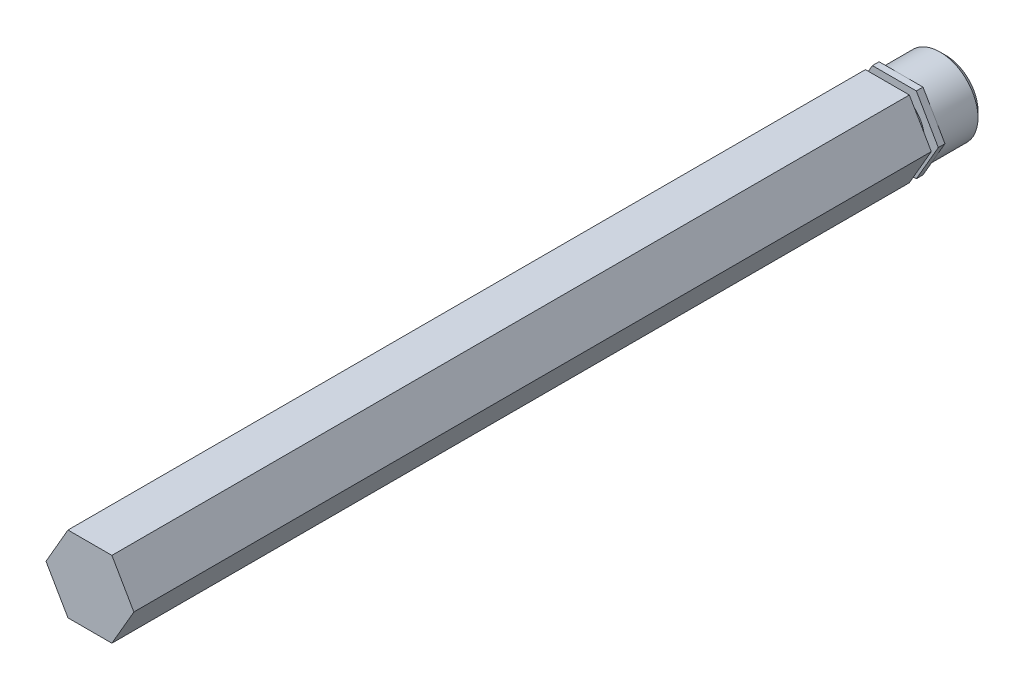
ISO-10303-21;
HEADER;
FILE_DESCRIPTION(('STEP AP214'),'2;1');
FILE_NAME('part.step','',(''),(''),'','','');
FILE_SCHEMA(('AUTOMOTIVE_DESIGN { 1 0 10303 214 1 1 1 1 }'));
ENDSEC;
DATA;
#1=APPLICATION_CONTEXT('core data for automotive mechanical design processes');
#2=APPLICATION_PROTOCOL_DEFINITION('international standard','automotive_design',2000,#1);
#3=PRODUCT_CONTEXT('',#1,'mechanical');
#4=PRODUCT('Part','Part','',(#3));
#5=PRODUCT_RELATED_PRODUCT_CATEGORY('part','',(#4));
#6=PRODUCT_DEFINITION_FORMATION('','',#4);
#7=PRODUCT_DEFINITION_CONTEXT('part definition',#1,'design');
#8=PRODUCT_DEFINITION('design','',#6,#7);
#9=PRODUCT_DEFINITION_SHAPE('','',#8);
#10=(LENGTH_UNIT() NAMED_UNIT(*) SI_UNIT(.MILLI.,.METRE.));
#11=(NAMED_UNIT(*) PLANE_ANGLE_UNIT() SI_UNIT($,.RADIAN.));
#12=(NAMED_UNIT(*) SI_UNIT($,.STERADIAN.) SOLID_ANGLE_UNIT());
#13=UNCERTAINTY_MEASURE_WITH_UNIT(LENGTH_MEASURE(1.E-05),#10,'distance_accuracy_value','');
#14=(GEOMETRIC_REPRESENTATION_CONTEXT(3) GLOBAL_UNCERTAINTY_ASSIGNED_CONTEXT((#13)) GLOBAL_UNIT_ASSIGNED_CONTEXT((#10,
#11,#12)) REPRESENTATION_CONTEXT('',''));
#15=CARTESIAN_POINT('',(0.,0.,0.));
#16=DIRECTION('',(0.,0.,1.));
#17=DIRECTION('',(1.,0.,0.));
#18=AXIS2_PLACEMENT_3D('',#15,#16,#17);
#19=CARTESIAN_POINT('',(7.33234841870822,0.,-76.1999999999995));
#20=DIRECTION('',(0.,0.,1.));
#21=DIRECTION('',(0.,-1.,0.));
#22=AXIS2_PLACEMENT_3D('',#19,#20,#21);
#23=PLANE('',#22);
#24=CARTESIAN_POINT('',(0.,0.,-76.1999999999148));
#25=DIRECTION('',(0.,0.,1.));
#26=DIRECTION('',(1.,0.,0.));
#27=AXIS2_PLACEMENT_3D('',#24,#25,#26);
#28=CIRCLE('',#27,5.34999999996444);
#29=CARTESIAN_POINT('',(5.34999999996444,0.,-76.1999999999148));
#30=VERTEX_POINT('',#29);
#31=EDGE_CURVE('E20',#30,#30,#28,.T.);
#32=ORIENTED_EDGE('',*,*,#31,.F.);
#33=EDGE_LOOP('',(#32));
#34=FACE_BOUND('',#33,.T.);
#35=ADVANCED_FACE('F17',(#34),#23,.F.);
#36=CARTESIAN_POINT('',(0.,0.,-75.2000000000521));
#37=DIRECTION('',(0.,0.,1.));
#38=DIRECTION('',(1.,0.,0.));
#39=AXIS2_PLACEMENT_3D('',#36,#37,#38);
#40=CONICAL_SURFACE('',#39,6.34999999982711,0.785398163397448);
#41=ORIENTED_EDGE('',*,*,#31,.T.);
#42=EDGE_LOOP('',(#41));
#43=FACE_BOUND('',#42,.T.);
#44=CARTESIAN_POINT('',(0.,0.,-75.1999999999995));
#45=DIRECTION('',(0.,0.,-1.));
#46=DIRECTION('',(0.,1.,0.));
#47=AXIS2_PLACEMENT_3D('',#44,#45,#46);
#48=CIRCLE('',#47,6.34999999999998);
#49=CARTESIAN_POINT('',(0.,6.34999999999997,-75.1999999999995));
#50=VERTEX_POINT('',#49);
#51=EDGE_CURVE('E134',#50,#50,#48,.F.);
#52=ORIENTED_EDGE('',*,*,#51,.F.);
#53=EDGE_LOOP('',(#52));
#54=FACE_BOUND('',#53,.T.);
#55=ADVANCED_FACE('F504',(#43,#54),#40,.T.);
#56=CARTESIAN_POINT('',(0.,0.,-68.7039999999995));
#57=DIRECTION('',(0.,0.,-1.));
#58=DIRECTION('',(0.,1.,0.));
#59=AXIS2_PLACEMENT_3D('',#56,#57,#58);
#60=CYLINDRICAL_SURFACE('',#59,6.34999999999998);
#61=CARTESIAN_POINT('',(0.,0.,-68.7039999999995));
#62=DIRECTION('',(0.,0.,-1.));
#63=DIRECTION('',(0.,1.,0.));
#64=AXIS2_PLACEMENT_3D('',#61,#62,#63);
#65=CIRCLE('',#64,6.34999999999998);
#66=CARTESIAN_POINT('',(5.49926131403117,-3.175,-68.7039999999995));
#67=VERTEX_POINT('',#66);
#68=CARTESIAN_POINT('',(5.49926131403118,3.17499999999998,-68.7039999999995));
#69=VERTEX_POINT('',#68);
#70=EDGE_CURVE('E121',#67,#69,#65,.F.);
#71=ORIENTED_EDGE('',*,*,#70,.F.);
#72=CARTESIAN_POINT('',(0.,0.,-68.7039999999995));
#73=DIRECTION('',(0.,0.,-1.));
#74=DIRECTION('',(0.,1.,0.));
#75=AXIS2_PLACEMENT_3D('',#72,#73,#74);
#76=CIRCLE('',#75,6.34999999999998);
#77=CARTESIAN_POINT('',(0.,-6.35000000000001,-68.7039999999995));
#78=VERTEX_POINT('',#77);
#79=EDGE_CURVE('E129',#78,#67,#76,.F.);
#80=ORIENTED_EDGE('',*,*,#79,.F.);
#81=CARTESIAN_POINT('',(0.,0.,-68.7039999999995));
#82=DIRECTION('',(0.,0.,-1.));
#83=DIRECTION('',(0.,1.,0.));
#84=AXIS2_PLACEMENT_3D('',#81,#82,#83);
#85=CIRCLE('',#84,6.34999999999998);
#86=CARTESIAN_POINT('',(-5.49926131403118,-3.17500000000001,-68.7039999999995));
#87=VERTEX_POINT('',#86);
#88=EDGE_CURVE('E142',#87,#78,#85,.F.);
#89=ORIENTED_EDGE('',*,*,#88,.F.);
#90=CARTESIAN_POINT('',(0.,0.,-68.7039999999995));
#91=DIRECTION('',(0.,0.,-1.));
#92=DIRECTION('',(0.,1.,0.));
#93=AXIS2_PLACEMENT_3D('',#90,#91,#92);
#94=CIRCLE('',#93,6.34999999999998);
#95=CARTESIAN_POINT('',(-5.49926131403118,3.17499999999998,-68.7039999999995));
#96=VERTEX_POINT('',#95);
#97=EDGE_CURVE('E143',#96,#87,#94,.F.);
#98=ORIENTED_EDGE('',*,*,#97,.F.);
#99=CARTESIAN_POINT('',(0.,0.,-68.7039999999995));
#100=DIRECTION('',(0.,0.,-1.));
#101=DIRECTION('',(0.,1.,0.));
#102=AXIS2_PLACEMENT_3D('',#99,#100,#101);
#103=CIRCLE('',#102,6.34999999999998);
#104=CARTESIAN_POINT('',(0.,6.34999999999999,-68.7039999999995));
#105=VERTEX_POINT('',#104);
#106=EDGE_CURVE('E178',#105,#96,#103,.F.);
#107=ORIENTED_EDGE('',*,*,#106,.F.);
#108=CARTESIAN_POINT('',(0.,0.,-68.7039999999995));
#109=DIRECTION('',(0.,0.,-1.));
#110=DIRECTION('',(0.,1.,0.));
#111=AXIS2_PLACEMENT_3D('',#108,#109,#110);
#112=CIRCLE('',#111,6.34999999999998);
#113=EDGE_CURVE('E132',#69,#105,#112,.F.);
#114=ORIENTED_EDGE('',*,*,#113,.F.);
#115=EDGE_LOOP('',(#71,#80,#89,#98,#107,#114));
#116=FACE_BOUND('',#115,.T.);
#117=ORIENTED_EDGE('',*,*,#51,.T.);
#118=EDGE_LOOP('',(#117));
#119=FACE_BOUND('',#118,.T.);
#120=ADVANCED_FACE('F126',(#116,#119),#60,.T.);
#121=CARTESIAN_POINT('',(0.,0.,-68.7039999999995));
#122=DIRECTION('',(0.,0.,-1.));
#123=DIRECTION('',(0.,1.,0.));
#124=AXIS2_PLACEMENT_3D('',#121,#122,#123);
#125=PLANE('',#124);
#126=DIRECTION('',(-0.499999999999999,-0.866025403784439,0.));
#127=VECTOR('',#126,1.);
#128=CARTESIAN_POINT('',(3.66617420935408,-6.35000000000003,-68.7039999999995));
#129=LINE('',#128,#127);
#130=CARTESIAN_POINT('',(7.33234841870823,0.,-68.7039999999995));
#131=VERTEX_POINT('',#130);
#132=EDGE_CURVE('E149',#131,#67,#129,.T.);
#133=ORIENTED_EDGE('',*,*,#132,.T.);
#134=ORIENTED_EDGE('',*,*,#70,.T.);
#135=DIRECTION('',(0.5,-0.866025403784439,0.));
#136=VECTOR('',#135,1.);
#137=CARTESIAN_POINT('',(7.33234841870824,0.,-68.7039999999995));
#138=LINE('',#137,#136);
#139=EDGE_CURVE('E156',#69,#131,#138,.T.);
#140=ORIENTED_EDGE('',*,*,#139,.T.);
#141=EDGE_LOOP('',(#133,#134,#140));
#142=FACE_BOUND('',#141,.T.);
#143=ADVANCED_FACE('F155',(#142),#125,.T.);
#144=CARTESIAN_POINT('',(0.,0.,-68.7039999999995));
#145=DIRECTION('',(0.,0.,-1.));
#146=DIRECTION('',(0.,1.,0.));
#147=AXIS2_PLACEMENT_3D('',#144,#145,#146);
#148=PLANE('',#147);
#149=DIRECTION('',(0.5,-0.866025403784439,0.));
#150=VECTOR('',#149,1.);
#151=CARTESIAN_POINT('',(7.33234841870824,0.,-68.7039999999995));
#152=LINE('',#151,#150);
#153=CARTESIAN_POINT('',(3.66617420935411,6.35000000000001,-68.7039999999995));
#154=VERTEX_POINT('',#153);
#155=EDGE_CURVE('E153',#154,#69,#152,.T.);
#156=ORIENTED_EDGE('',*,*,#155,.T.);
#157=ORIENTED_EDGE('',*,*,#113,.T.);
#158=DIRECTION('',(1.,0.,0.));
#159=VECTOR('',#158,1.);
#160=CARTESIAN_POINT('',(3.6661742093541,6.35000000000002,-68.7039999999995));
#161=LINE('',#160,#159);
#162=EDGE_CURVE('E186',#105,#154,#161,.T.);
#163=ORIENTED_EDGE('',*,*,#162,.T.);
#164=EDGE_LOOP('',(#156,#157,#163));
#165=FACE_BOUND('',#164,.T.);
#166=ADVANCED_FACE('F184',(#165),#148,.T.);
#167=CARTESIAN_POINT('',(0.,0.,-68.7039999999995));
#168=DIRECTION('',(0.,0.,-1.));
#169=DIRECTION('',(0.,1.,0.));
#170=AXIS2_PLACEMENT_3D('',#167,#168,#169);
#171=PLANE('',#170);
#172=ORIENTED_EDGE('',*,*,#106,.T.);
#173=DIRECTION('',(0.5,0.866025403784439,0.));
#174=VECTOR('',#173,1.);
#175=CARTESIAN_POINT('',(-3.66617420935412,6.35000000000001,-68.7039999999995));
#176=LINE('',#175,#174);
#177=CARTESIAN_POINT('',(-3.66617420935412,6.35000000000001,-68.7039999999995));
#178=VERTEX_POINT('',#177);
#179=EDGE_CURVE('E202',#96,#178,#176,.T.);
#180=ORIENTED_EDGE('',*,*,#179,.T.);
#181=DIRECTION('',(1.,0.,0.));
#182=VECTOR('',#181,1.);
#183=CARTESIAN_POINT('',(3.6661742093541,6.35000000000002,-68.7039999999995));
#184=LINE('',#183,#182);
#185=EDGE_CURVE('E195',#178,#105,#184,.T.);
#186=ORIENTED_EDGE('',*,*,#185,.T.);
#187=EDGE_LOOP('',(#172,#180,#186));
#188=FACE_BOUND('',#187,.T.);
#189=ADVANCED_FACE('F201',(#188),#171,.T.);
#190=CARTESIAN_POINT('',(0.,0.,-68.7039999999995));
#191=DIRECTION('',(0.,0.,-1.));
#192=DIRECTION('',(0.,1.,0.));
#193=AXIS2_PLACEMENT_3D('',#190,#191,#192);
#194=PLANE('',#193);
#195=ORIENTED_EDGE('',*,*,#97,.T.);
#196=DIRECTION('',(-0.500000000000001,0.866025403784438,0.));
#197=VECTOR('',#196,1.);
#198=CARTESIAN_POINT('',(-7.33234841870825,0.,-68.7039999999995));
#199=LINE('',#198,#197);
#200=CARTESIAN_POINT('',(-7.33234841870826,0.,-68.7039999999995));
#201=VERTEX_POINT('',#200);
#202=EDGE_CURVE('E240',#87,#201,#199,.T.);
#203=ORIENTED_EDGE('',*,*,#202,.T.);
#204=DIRECTION('',(0.5,0.866025403784439,0.));
#205=VECTOR('',#204,1.);
#206=CARTESIAN_POINT('',(-3.66617420935412,6.35000000000001,-68.7039999999995));
#207=LINE('',#206,#205);
#208=EDGE_CURVE('E214',#201,#96,#207,.T.);
#209=ORIENTED_EDGE('',*,*,#208,.T.);
#210=EDGE_LOOP('',(#195,#203,#209));
#211=FACE_BOUND('',#210,.T.);
#212=ADVANCED_FACE('F468',(#211),#194,.T.);
#213=CARTESIAN_POINT('',(0.,0.,-68.7039999999995));
#214=DIRECTION('',(0.,0.,-1.));
#215=DIRECTION('',(0.,1.,0.));
#216=AXIS2_PLACEMENT_3D('',#213,#214,#215);
#217=PLANE('',#216);
#218=DIRECTION('',(-1.,0.,0.));
#219=VECTOR('',#218,1.);
#220=CARTESIAN_POINT('',(-3.66617420935412,-6.35000000000002,-68.7039999999995));
#221=LINE('',#220,#219);
#222=CARTESIAN_POINT('',(3.66617420935408,-6.35000000000002,-68.7039999999995));
#223=VERTEX_POINT('',#222);
#224=EDGE_CURVE('E141',#223,#78,#221,.T.);
#225=ORIENTED_EDGE('',*,*,#224,.T.);
#226=ORIENTED_EDGE('',*,*,#79,.T.);
#227=DIRECTION('',(-0.499999999999999,-0.866025403784439,0.));
#228=VECTOR('',#227,1.);
#229=CARTESIAN_POINT('',(3.66617420935408,-6.35000000000003,-68.7039999999995));
#230=LINE('',#229,#228);
#231=EDGE_CURVE('E139',#67,#223,#230,.T.);
#232=ORIENTED_EDGE('',*,*,#231,.T.);
#233=EDGE_LOOP('',(#225,#226,#232));
#234=FACE_BOUND('',#233,.T.);
#235=ADVANCED_FACE('F138',(#234),#217,.T.);
#236=CARTESIAN_POINT('',(0.,0.,-68.7039999999995));
#237=DIRECTION('',(0.,0.,-1.));
#238=DIRECTION('',(0.,1.,0.));
#239=AXIS2_PLACEMENT_3D('',#236,#237,#238);
#240=PLANE('',#239);
#241=ORIENTED_EDGE('',*,*,#88,.T.);
#242=DIRECTION('',(-1.,0.,0.));
#243=VECTOR('',#242,1.);
#244=CARTESIAN_POINT('',(-3.66617420935412,-6.35000000000002,-68.7039999999995));
#245=LINE('',#244,#243);
#246=CARTESIAN_POINT('',(-3.66617420935413,-6.35000000000002,-68.7039999999995));
#247=VERTEX_POINT('',#246);
#248=EDGE_CURVE('E291',#78,#247,#245,.T.);
#249=ORIENTED_EDGE('',*,*,#248,.T.);
#250=DIRECTION('',(-0.500000000000001,0.866025403784438,0.));
#251=VECTOR('',#250,1.);
#252=CARTESIAN_POINT('',(-7.33234841870825,0.,-68.7039999999995));
#253=LINE('',#252,#251);
#254=EDGE_CURVE('E237',#247,#87,#253,.T.);
#255=ORIENTED_EDGE('',*,*,#254,.T.);
#256=EDGE_LOOP('',(#241,#249,#255));
#257=FACE_BOUND('',#256,.T.);
#258=ADVANCED_FACE('F296',(#257),#240,.T.);
#259=CARTESIAN_POINT('',(3.66617420935408,-6.35000000000003,76.1999999999996));
#260=DIRECTION('',(-0.866025403784439,0.499999999999999,0.));
#261=DIRECTION('',(-0.499999999999999,-0.866025403784439,0.));
#262=AXIS2_PLACEMENT_3D('',#259,#260,#261);
#263=PLANE('',#262);
#264=DIRECTION('',(0.,0.,1.));
#265=VECTOR('',#264,1.);
#266=CARTESIAN_POINT('',(3.66617420935408,-6.35000000000002,76.1999999999996));
#267=LINE('',#266,#265);
#268=CARTESIAN_POINT('',(3.66617420935408,-6.35000000000002,-67.5923999999995));
#269=VERTEX_POINT('',#268);
#270=EDGE_CURVE('E152',#269,#223,#267,.F.);
#271=ORIENTED_EDGE('',*,*,#270,.T.);
#272=ORIENTED_EDGE('',*,*,#231,.F.);
#273=ORIENTED_EDGE('',*,*,#132,.F.);
#274=DIRECTION('',(0.,0.,1.));
#275=VECTOR('',#274,1.);
#276=CARTESIAN_POINT('',(7.33234841870823,0.,76.1999999999996));
#277=LINE('',#276,#275);
#278=CARTESIAN_POINT('',(7.33234841870822,0.,-67.5923999999995));
#279=VERTEX_POINT('',#278);
#280=EDGE_CURVE('E203',#131,#279,#277,.T.);
#281=ORIENTED_EDGE('',*,*,#280,.T.);
#282=DIRECTION('',(0.500000000000002,0.866025403784438,0.));
#283=VECTOR('',#282,1.);
#284=CARTESIAN_POINT('',(3.66617420935408,-6.35000000000001,-67.5923999999996));
#285=LINE('',#284,#283);
#286=EDGE_CURVE('E262',#269,#279,#285,.T.);
#287=ORIENTED_EDGE('',*,*,#286,.F.);
#288=EDGE_LOOP('',(#271,#272,#273,#281,#287));
#289=FACE_BOUND('',#288,.T.);
#290=ADVANCED_FACE('F147',(#289),#263,.F.);
#291=CARTESIAN_POINT('',(7.33234841870824,0.,76.1999999999996));
#292=DIRECTION('',(-0.866025403784439,-0.5,0.));
#293=DIRECTION('',(0.5,-0.866025403784439,0.));
#294=AXIS2_PLACEMENT_3D('',#291,#292,#293);
#295=PLANE('',#294);
#296=ORIENTED_EDGE('',*,*,#280,.F.);
#297=ORIENTED_EDGE('',*,*,#139,.F.);
#298=ORIENTED_EDGE('',*,*,#155,.F.);
#299=DIRECTION('',(0.,0.,-1.));
#300=VECTOR('',#299,1.);
#301=CARTESIAN_POINT('',(3.6661742093541,6.35000000000002,76.1999999999996));
#302=LINE('',#301,#300);
#303=CARTESIAN_POINT('',(3.6661742093541,6.35000000000001,-67.5923999999995));
#304=VERTEX_POINT('',#303);
#305=EDGE_CURVE('E199',#154,#304,#302,.F.);
#306=ORIENTED_EDGE('',*,*,#305,.T.);
#307=DIRECTION('',(-0.499999999999999,0.866025403784439,0.));
#308=VECTOR('',#307,1.);
#309=CARTESIAN_POINT('',(7.33234841870822,0.,-67.5923999999996));
#310=LINE('',#309,#308);
#311=EDGE_CURVE('E264',#279,#304,#310,.T.);
#312=ORIENTED_EDGE('',*,*,#311,.F.);
#313=EDGE_LOOP('',(#296,#297,#298,#306,#312));
#314=FACE_BOUND('',#313,.T.);
#315=ADVANCED_FACE('F301',(#314),#295,.F.);
#316=CARTESIAN_POINT('',(3.6661742093541,6.35000000000002,76.1999999999996));
#317=DIRECTION('',(0.,-1.,0.));
#318=DIRECTION('',(0.,0.,-1.));
#319=AXIS2_PLACEMENT_3D('',#316,#317,#318);
#320=PLANE('',#319);
#321=ORIENTED_EDGE('',*,*,#305,.F.);
#322=ORIENTED_EDGE('',*,*,#162,.F.);
#323=ORIENTED_EDGE('',*,*,#185,.F.);
#324=DIRECTION('',(0.,0.,1.));
#325=VECTOR('',#324,1.);
#326=CARTESIAN_POINT('',(-3.66617420935412,6.35,76.1999999999996));
#327=LINE('',#326,#325);
#328=CARTESIAN_POINT('',(-3.66617420935412,6.35000000000001,-67.5923999999995));
#329=VERTEX_POINT('',#328);
#330=EDGE_CURVE('E228',#178,#329,#327,.T.);
#331=ORIENTED_EDGE('',*,*,#330,.T.);
#332=DIRECTION('',(1.,0.,0.));
#333=VECTOR('',#332,1.);
#334=CARTESIAN_POINT('',(0.,6.35000000000001,-67.5923999999996));
#335=LINE('',#334,#333);
#336=EDGE_CURVE('E283',#304,#329,#335,.F.);
#337=ORIENTED_EDGE('',*,*,#336,.F.);
#338=EDGE_LOOP('',(#321,#322,#323,#331,#337));
#339=FACE_BOUND('',#338,.T.);
#340=ADVANCED_FACE('F193',(#339),#320,.F.);
#341=CARTESIAN_POINT('',(-3.66617420935412,6.35000000000001,76.1999999999996));
#342=DIRECTION('',(0.866025403784439,-0.5,0.));
#343=DIRECTION('',(0.5,0.866025403784439,0.));
#344=AXIS2_PLACEMENT_3D('',#341,#342,#343);
#345=PLANE('',#344);
#346=ORIENTED_EDGE('',*,*,#330,.F.);
#347=ORIENTED_EDGE('',*,*,#179,.F.);
#348=ORIENTED_EDGE('',*,*,#208,.F.);
#349=DIRECTION('',(0.,0.,1.));
#350=VECTOR('',#349,1.);
#351=CARTESIAN_POINT('',(-7.33234841870826,0.,76.1999999999996));
#352=LINE('',#351,#350);
#353=CARTESIAN_POINT('',(-7.33234841870826,0.,-67.5923999999995));
#354=VERTEX_POINT('',#353);
#355=EDGE_CURVE('E244',#201,#354,#352,.T.);
#356=ORIENTED_EDGE('',*,*,#355,.T.);
#357=DIRECTION('',(-0.5,-0.866025403784438,0.));
#358=VECTOR('',#357,1.);
#359=CARTESIAN_POINT('',(-3.66617420935412,6.35,-67.5923999999996));
#360=LINE('',#359,#358);
#361=EDGE_CURVE('E274',#329,#354,#360,.T.);
#362=ORIENTED_EDGE('',*,*,#361,.F.);
#363=EDGE_LOOP('',(#346,#347,#348,#356,#362));
#364=FACE_BOUND('',#363,.T.);
#365=ADVANCED_FACE('F273',(#364),#345,.F.);
#366=CARTESIAN_POINT('',(-7.33234841870825,0.,76.1999999999996));
#367=DIRECTION('',(0.866025403784438,0.500000000000001,0.));
#368=DIRECTION('',(-0.500000000000001,0.866025403784438,0.));
#369=AXIS2_PLACEMENT_3D('',#366,#367,#368);
#370=PLANE('',#369);
#371=ORIENTED_EDGE('',*,*,#355,.F.);
#372=ORIENTED_EDGE('',*,*,#202,.F.);
#373=ORIENTED_EDGE('',*,*,#254,.F.);
#374=DIRECTION('',(0.,0.,1.));
#375=VECTOR('',#374,1.);
#376=CARTESIAN_POINT('',(-3.66617420935413,-6.35000000000002,76.1999999999996));
#377=LINE('',#376,#375);
#378=CARTESIAN_POINT('',(-3.66617420935413,-6.35000000000002,-67.5923999999995));
#379=VERTEX_POINT('',#378);
#380=EDGE_CURVE('E265',#247,#379,#377,.T.);
#381=ORIENTED_EDGE('',*,*,#380,.T.);
#382=DIRECTION('',(0.500000000000001,-0.866025403784438,0.));
#383=VECTOR('',#382,1.);
#384=CARTESIAN_POINT('',(-7.33234841870825,0.,-67.5923999999996));
#385=LINE('',#384,#383);
#386=EDGE_CURVE('E259',#354,#379,#385,.T.);
#387=ORIENTED_EDGE('',*,*,#386,.F.);
#388=EDGE_LOOP('',(#371,#372,#373,#381,#387));
#389=FACE_BOUND('',#388,.T.);
#390=ADVANCED_FACE('F278',(#389),#370,.F.);
#391=CARTESIAN_POINT('',(-3.66617420935412,-6.35000000000002,76.1999999999996));
#392=DIRECTION('',(0.,1.,0.));
#393=DIRECTION('',(-1.,0.,0.));
#394=AXIS2_PLACEMENT_3D('',#391,#392,#393);
#395=PLANE('',#394);
#396=ORIENTED_EDGE('',*,*,#380,.F.);
#397=ORIENTED_EDGE('',*,*,#248,.F.);
#398=ORIENTED_EDGE('',*,*,#224,.F.);
#399=ORIENTED_EDGE('',*,*,#270,.F.);
#400=DIRECTION('',(1.,0.,0.));
#401=VECTOR('',#400,1.);
#402=CARTESIAN_POINT('',(0.,-6.35000000000001,-67.5923999999996));
#403=LINE('',#402,#401);
#404=EDGE_CURVE('E175',#379,#269,#403,.T.);
#405=ORIENTED_EDGE('',*,*,#404,.F.);
#406=EDGE_LOOP('',(#396,#397,#398,#399,#405));
#407=FACE_BOUND('',#406,.T.);
#408=ADVANCED_FACE('F298',(#407),#395,.F.);
#409=CARTESIAN_POINT('',(0.,9.67349289505183,-67.5923999999996));
#410=DIRECTION('',(0.,0.,1.));
#411=DIRECTION('',(0.,-1.,0.));
#412=AXIS2_PLACEMENT_3D('',#409,#410,#411);
#413=PLANE('',#412);
#414=ORIENTED_EDGE('',*,*,#386,.T.);
#415=ORIENTED_EDGE('',*,*,#404,.T.);
#416=ORIENTED_EDGE('',*,*,#286,.T.);
#417=ORIENTED_EDGE('',*,*,#311,.T.);
#418=ORIENTED_EDGE('',*,*,#336,.T.);
#419=ORIENTED_EDGE('',*,*,#361,.T.);
#420=EDGE_LOOP('',(#414,#415,#416,#417,#418,#419));
#421=FACE_BOUND('',#420,.T.);
#422=CARTESIAN_POINT('',(0.,0.,-67.5923999999996));
#423=DIRECTION('',(0.,0.,1.));
#424=DIRECTION('',(0.,-1.,0.));
#425=AXIS2_PLACEMENT_3D('',#422,#423,#424);
#426=CIRCLE('',#425,5.02919999999999);
#427=CARTESIAN_POINT('',(0.,-5.02919999999999,-67.5923999999996));
#428=VERTEX_POINT('',#427);
#429=EDGE_CURVE('E172',#428,#428,#426,.T.);
#430=ORIENTED_EDGE('',*,*,#429,.F.);
#431=EDGE_LOOP('',(#430));
#432=FACE_BOUND('',#431,.T.);
#433=ADVANCED_FACE('F299',(#421,#432),#413,.T.);
#434=CARTESIAN_POINT('',(0.,0.,-56.8163271417916));
#435=DIRECTION('',(0.,0.,1.));
#436=DIRECTION('',(0.,-1.,0.));
#437=AXIS2_PLACEMENT_3D('',#434,#435,#436);
#438=CYLINDRICAL_SURFACE('',#437,5.02919999999999);
#439=ORIENTED_EDGE('',*,*,#429,.T.);
#440=EDGE_LOOP('',(#439));
#441=FACE_BOUND('',#440,.T.);
#442=CARTESIAN_POINT('',(0.,0.,-66.4239999999996));
#443=DIRECTION('',(0.,0.,1.));
#444=DIRECTION('',(0.,-1.,0.));
#445=AXIS2_PLACEMENT_3D('',#442,#443,#444);
#446=CIRCLE('',#445,5.02919999999999);
#447=CARTESIAN_POINT('',(0.,-5.02919999999999,-66.4239999999996));
#448=VERTEX_POINT('',#447);
#449=EDGE_CURVE('E167',#448,#448,#446,.T.);
#450=ORIENTED_EDGE('',*,*,#449,.F.);
#451=EDGE_LOOP('',(#450));
#452=FACE_BOUND('',#451,.T.);
#453=ADVANCED_FACE('F345',(#441,#452),#438,.T.);
#454=CARTESIAN_POINT('',(-3.66617420935412,-6.35000000000002,76.1999999999996));
#455=DIRECTION('',(0.,1.,0.));
#456=DIRECTION('',(-1.,0.,0.));
#457=AXIS2_PLACEMENT_3D('',#454,#455,#456);
#458=PLANE('',#457);
#459=DIRECTION('',(0.,0.,1.));
#460=VECTOR('',#459,1.);
#461=CARTESIAN_POINT('',(-3.66617420935412,-6.35000000000003,76.1999999999996));
#462=LINE('',#461,#460);
#463=CARTESIAN_POINT('',(-3.66617420935412,-6.35000000000003,66.6749999999996));
#464=VERTEX_POINT('',#463);
#465=CARTESIAN_POINT('',(-3.66617420935412,-6.35000000000002,-66.4239999999995));
#466=VERTEX_POINT('',#465);
#467=EDGE_CURVE('E171',#464,#466,#462,.F.);
#468=ORIENTED_EDGE('',*,*,#467,.T.);
#469=DIRECTION('',(1.,0.,0.));
#470=VECTOR('',#469,1.);
#471=CARTESIAN_POINT('',(0.,-6.35000000000001,-66.4239999999996));
#472=LINE('',#471,#470);
#473=CARTESIAN_POINT('',(3.66617420935409,-6.35000000000002,-66.4239999999996));
#474=VERTEX_POINT('',#473);
#475=EDGE_CURVE('E548',#474,#466,#472,.F.);
#476=ORIENTED_EDGE('',*,*,#475,.F.);
#477=DIRECTION('',(0.,0.,1.));
#478=VECTOR('',#477,1.);
#479=CARTESIAN_POINT('',(3.66617420935409,-6.35000000000002,76.1999999999996));
#480=LINE('',#479,#478);
#481=CARTESIAN_POINT('',(3.6661742093541,-6.35000000000002,66.6749999999996));
#482=VERTEX_POINT('',#481);
#483=EDGE_CURVE('E174',#474,#482,#480,.T.);
#484=ORIENTED_EDGE('',*,*,#483,.T.);
#485=DIRECTION('',(1.,0.,0.));
#486=VECTOR('',#485,1.);
#487=CARTESIAN_POINT('',(0.,-6.35000000000003,66.6749999999996));
#488=LINE('',#487,#486);
#489=EDGE_CURVE('E549',#464,#482,#488,.T.);
#490=ORIENTED_EDGE('',*,*,#489,.F.);
#491=EDGE_LOOP('',(#468,#476,#484,#490));
#492=FACE_BOUND('',#491,.T.);
#493=ADVANCED_FACE('F341',(#492),#458,.F.);
#494=CARTESIAN_POINT('',(3.66617420935408,-6.35000000000003,76.1999999999996));
#495=DIRECTION('',(-0.866025403784439,0.499999999999999,0.));
#496=DIRECTION('',(-0.499999999999999,-0.866025403784439,0.));
#497=AXIS2_PLACEMENT_3D('',#494,#495,#496);
#498=PLANE('',#497);
#499=ORIENTED_EDGE('',*,*,#483,.F.);
#500=DIRECTION('',(-0.500000000000002,-0.866025403784438,0.));
#501=VECTOR('',#500,1.);
#502=CARTESIAN_POINT('',(7.33234841870822,0.,-66.4239999999996));
#503=LINE('',#502,#501);
#504=CARTESIAN_POINT('',(7.33234841870822,0.,-66.4239999999996));
#505=VERTEX_POINT('',#504);
#506=EDGE_CURVE('E170',#505,#474,#503,.T.);
#507=ORIENTED_EDGE('',*,*,#506,.F.);
#508=DIRECTION('',(0.,0.,1.));
#509=VECTOR('',#508,1.);
#510=CARTESIAN_POINT('',(7.33234841870823,0.,76.1999999999996));
#511=LINE('',#510,#509);
#512=CARTESIAN_POINT('',(7.33234841870821,0.,66.6749999999996));
#513=VERTEX_POINT('',#512);
#514=EDGE_CURVE('E552',#505,#513,#511,.T.);
#515=ORIENTED_EDGE('',*,*,#514,.T.);
#516=DIRECTION('',(0.499999999999997,0.86602540378444,0.));
#517=VECTOR('',#516,1.);
#518=CARTESIAN_POINT('',(3.6661742093541,-6.35000000000005,66.6749999999996));
#519=LINE('',#518,#517);
#520=EDGE_CURVE('E572',#482,#513,#519,.T.);
#521=ORIENTED_EDGE('',*,*,#520,.F.);
#522=EDGE_LOOP('',(#499,#507,#515,#521));
#523=FACE_BOUND('',#522,.T.);
#524=ADVANCED_FACE('F337',(#523),#498,.F.);
#525=CARTESIAN_POINT('',(7.33234841870824,0.,76.1999999999996));
#526=DIRECTION('',(-0.866025403784439,-0.5,0.));
#527=DIRECTION('',(0.5,-0.866025403784439,0.));
#528=AXIS2_PLACEMENT_3D('',#525,#526,#527);
#529=PLANE('',#528);
#530=ORIENTED_EDGE('',*,*,#514,.F.);
#531=DIRECTION('',(0.499999999999999,-0.866025403784439,0.));
#532=VECTOR('',#531,1.);
#533=CARTESIAN_POINT('',(3.6661742093541,6.35000000000001,-66.4239999999996));
#534=LINE('',#533,#532);
#535=CARTESIAN_POINT('',(3.66617420935411,6.35,-66.4239999999996));
#536=VERTEX_POINT('',#535);
#537=EDGE_CURVE('E559',#536,#505,#534,.T.);
#538=ORIENTED_EDGE('',*,*,#537,.F.);
#539=DIRECTION('',(0.,0.,-1.));
#540=VECTOR('',#539,1.);
#541=CARTESIAN_POINT('',(3.6661742093541,6.35000000000002,76.1999999999996));
#542=LINE('',#541,#540);
#543=CARTESIAN_POINT('',(3.66617420935411,6.35,66.6749999999996));
#544=VERTEX_POINT('',#543);
#545=EDGE_CURVE('E576',#536,#544,#542,.F.);
#546=ORIENTED_EDGE('',*,*,#545,.T.);
#547=DIRECTION('',(-0.499999999999998,0.866025403784439,0.));
#548=VECTOR('',#547,1.);
#549=CARTESIAN_POINT('',(7.33234841870821,0.,66.6749999999996));
#550=LINE('',#549,#548);
#551=EDGE_CURVE('E573',#513,#544,#550,.T.);
#552=ORIENTED_EDGE('',*,*,#551,.F.);
#553=EDGE_LOOP('',(#530,#538,#546,#552));
#554=FACE_BOUND('',#553,.T.);
#555=ADVANCED_FACE('F333',(#554),#529,.F.);
#556=CARTESIAN_POINT('',(-7.33234841870825,0.,76.1999999999996));
#557=DIRECTION('',(0.866025403784438,0.500000000000001,0.));
#558=DIRECTION('',(-0.500000000000001,0.866025403784438,0.));
#559=AXIS2_PLACEMENT_3D('',#556,#557,#558);
#560=PLANE('',#559);
#561=DIRECTION('',(0.,0.,1.));
#562=VECTOR('',#561,1.);
#563=CARTESIAN_POINT('',(-7.33234841870826,0.,76.1999999999996));
#564=LINE('',#563,#562);
#565=CARTESIAN_POINT('',(-7.33234841870826,0.,66.6749999999996));
#566=VERTEX_POINT('',#565);
#567=CARTESIAN_POINT('',(-7.33234841870826,0.,-66.4239999999996));
#568=VERTEX_POINT('',#567);
#569=EDGE_CURVE('E556',#566,#568,#564,.F.);
#570=ORIENTED_EDGE('',*,*,#569,.T.);
#571=DIRECTION('',(-0.500000000000001,0.866025403784438,0.));
#572=VECTOR('',#571,1.);
#573=CARTESIAN_POINT('',(-3.66617420935413,-6.35000000000001,-66.4239999999996));
#574=LINE('',#573,#572);
#575=EDGE_CURVE('E555',#466,#568,#574,.T.);
#576=ORIENTED_EDGE('',*,*,#575,.F.);
#577=ORIENTED_EDGE('',*,*,#467,.F.);
#578=DIRECTION('',(0.500000000000001,-0.866025403784438,0.));
#579=VECTOR('',#578,1.);
#580=CARTESIAN_POINT('',(-7.33234841870826,0.,66.6749999999996));
#581=LINE('',#580,#579);
#582=EDGE_CURVE('E589',#566,#464,#581,.T.);
#583=ORIENTED_EDGE('',*,*,#582,.F.);
#584=EDGE_LOOP('',(#570,#576,#577,#583));
#585=FACE_BOUND('',#584,.T.);
#586=ADVANCED_FACE('F329',(#585),#560,.F.);
#587=CARTESIAN_POINT('',(0.,9.67349289505183,-66.4239999999996));
#588=DIRECTION('',(0.,0.,-1.));
#589=DIRECTION('',(0.,1.,0.));
#590=AXIS2_PLACEMENT_3D('',#587,#588,#589);
#591=PLANE('',#590);
#592=DIRECTION('',(1.,0.,0.));
#593=VECTOR('',#592,1.);
#594=CARTESIAN_POINT('',(3.6661742093541,6.35000000000002,-66.4239999999996));
#595=LINE('',#594,#593);
#596=CARTESIAN_POINT('',(-3.66617420935412,6.35,-66.4239999999996));
#597=VERTEX_POINT('',#596);
#598=EDGE_CURVE('E562',#597,#536,#595,.T.);
#599=ORIENTED_EDGE('',*,*,#598,.T.);
#600=ORIENTED_EDGE('',*,*,#537,.T.);
#601=ORIENTED_EDGE('',*,*,#506,.T.);
#602=ORIENTED_EDGE('',*,*,#475,.T.);
#603=ORIENTED_EDGE('',*,*,#575,.T.);
#604=DIRECTION('',(0.5,0.866025403784439,0.));
#605=VECTOR('',#604,1.);
#606=CARTESIAN_POINT('',(-3.66617420935412,6.35000000000001,-66.4239999999996));
#607=LINE('',#606,#605);
#608=EDGE_CURVE('E582',#568,#597,#607,.T.);
#609=ORIENTED_EDGE('',*,*,#608,.T.);
#610=EDGE_LOOP('',(#599,#600,#601,#602,#603,#609));
#611=FACE_BOUND('',#610,.T.);
#612=ORIENTED_EDGE('',*,*,#449,.T.);
#613=EDGE_LOOP('',(#612));
#614=FACE_BOUND('',#613,.T.);
#615=ADVANCED_FACE('F325',(#611,#614),#591,.T.);
#616=CARTESIAN_POINT('',(3.6661742093541,6.35000000000002,76.1999999999996));
#617=DIRECTION('',(0.,-1.,0.));
#618=DIRECTION('',(0.,0.,-1.));
#619=AXIS2_PLACEMENT_3D('',#616,#617,#618);
#620=PLANE('',#619);
#621=ORIENTED_EDGE('',*,*,#545,.F.);
#622=ORIENTED_EDGE('',*,*,#598,.F.);
#623=DIRECTION('',(0.,0.,1.));
#624=VECTOR('',#623,1.);
#625=CARTESIAN_POINT('',(-3.66617420935412,6.35,76.1999999999996));
#626=LINE('',#625,#624);
#627=CARTESIAN_POINT('',(-3.66617420935412,6.35,66.6749999999996));
#628=VERTEX_POINT('',#627);
#629=EDGE_CURVE('E26',#597,#628,#626,.T.);
#630=ORIENTED_EDGE('',*,*,#629,.T.);
#631=DIRECTION('',(1.,0.,0.));
#632=VECTOR('',#631,1.);
#633=CARTESIAN_POINT('',(0.,6.34999999999999,66.6749999999996));
#634=LINE('',#633,#632);
#635=EDGE_CURVE('E34',#544,#628,#634,.F.);
#636=ORIENTED_EDGE('',*,*,#635,.F.);
#637=EDGE_LOOP('',(#621,#622,#630,#636));
#638=FACE_BOUND('',#637,.T.);
#639=ADVANCED_FACE('F319',(#638),#620,.F.);
#640=CARTESIAN_POINT('',(0.,0.,66.6749999999996));
#641=DIRECTION('',(0.,0.,1.));
#642=DIRECTION('',(0.,-1.,0.));
#643=AXIS2_PLACEMENT_3D('',#640,#641,#642);
#644=PLANE('',#643);
#645=DIRECTION('',(0.5,0.866025403784439,0.));
#646=VECTOR('',#645,1.);
#647=CARTESIAN_POINT('',(-3.66617420935412,6.35000000000001,66.6749999999996));
#648=LINE('',#647,#646);
#649=EDGE_CURVE('E11',#628,#566,#648,.F.);
#650=ORIENTED_EDGE('',*,*,#649,.T.);
#651=ORIENTED_EDGE('',*,*,#582,.T.);
#652=ORIENTED_EDGE('',*,*,#489,.T.);
#653=ORIENTED_EDGE('',*,*,#520,.T.);
#654=ORIENTED_EDGE('',*,*,#551,.T.);
#655=ORIENTED_EDGE('',*,*,#635,.T.);
#656=EDGE_LOOP('',(#650,#651,#652,#653,#654,#655));
#657=FACE_BOUND('',#656,.T.);
#658=ADVANCED_FACE('F313',(#657),#644,.T.);
#659=CARTESIAN_POINT('',(-3.66617420935412,6.35000000000001,76.1999999999996));
#660=DIRECTION('',(0.866025403784439,-0.5,0.));
#661=DIRECTION('',(0.5,0.866025403784439,0.));
#662=AXIS2_PLACEMENT_3D('',#659,#660,#661);
#663=PLANE('',#662);
#664=ORIENTED_EDGE('',*,*,#629,.F.);
#665=ORIENTED_EDGE('',*,*,#608,.F.);
#666=ORIENTED_EDGE('',*,*,#569,.F.);
#667=ORIENTED_EDGE('',*,*,#649,.F.);
#668=EDGE_LOOP('',(#664,#665,#666,#667));
#669=FACE_BOUND('',#668,.T.);
#670=ADVANCED_FACE('F311',(#669),#663,.F.);
#671=CLOSED_SHELL('',(#35,#55,#120,#143,#166,#189,#212,#235,#258,#290,#315,#340,#365,#390,#408,
#433,#453,#493,#524,#555,#586,#615,#639,#658,#670));
#672=MANIFOLD_SOLID_BREP('B1',#671);
#673=ADVANCED_BREP_SHAPE_REPRESENTATION('',(#18,#672),#14);
#674=SHAPE_DEFINITION_REPRESENTATION(#9,#673);
ENDSEC;
END-ISO-10303-21;
